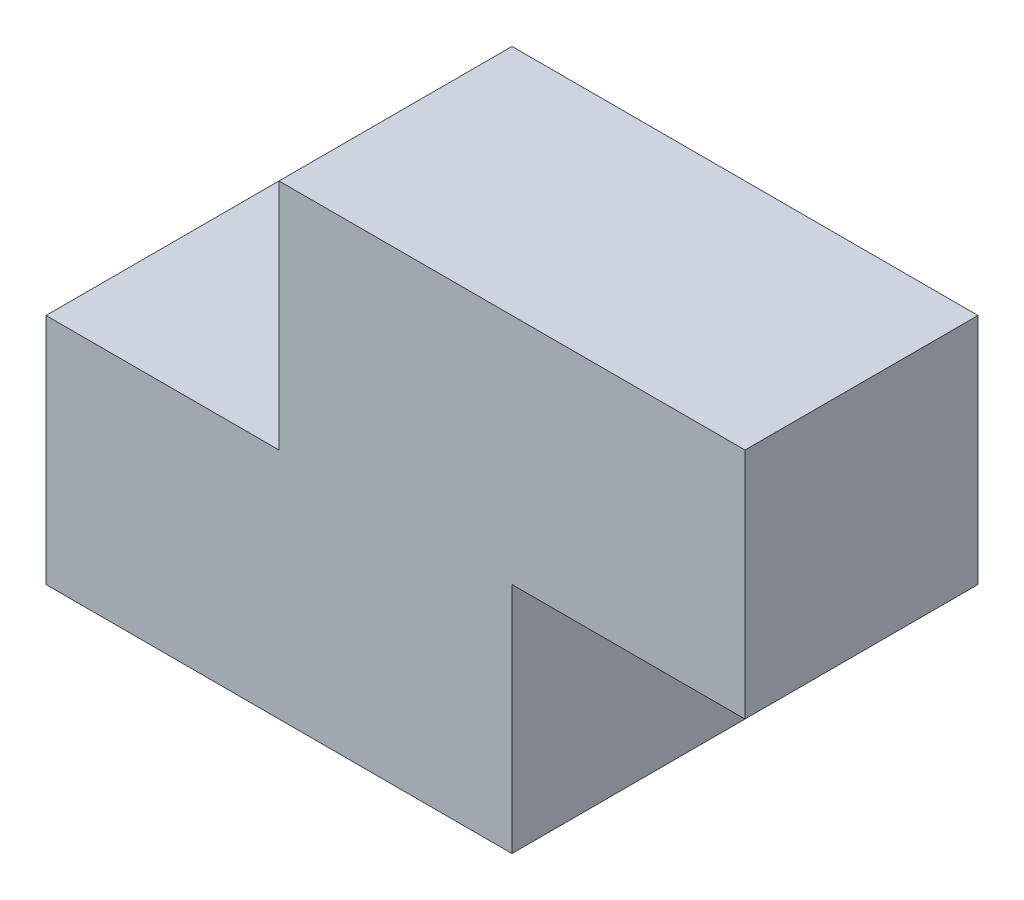
ISO-10303-21;
HEADER;
FILE_DESCRIPTION(('STEP AP214'),'2;1');
FILE_NAME('part.step','',(''),(''),'','','');
FILE_SCHEMA(('AUTOMOTIVE_DESIGN { 1 0 10303 214 1 1 1 1 }'));
ENDSEC;
DATA;
#1=APPLICATION_CONTEXT('core data for automotive mechanical design processes');
#2=APPLICATION_PROTOCOL_DEFINITION('international standard','automotive_design',2000,#1);
#3=PRODUCT_CONTEXT('',#1,'mechanical');
#4=PRODUCT('Part','Part','',(#3));
#5=PRODUCT_RELATED_PRODUCT_CATEGORY('part','',(#4));
#6=PRODUCT_DEFINITION_FORMATION('','',#4);
#7=PRODUCT_DEFINITION_CONTEXT('part definition',#1,'design');
#8=PRODUCT_DEFINITION('design','',#6,#7);
#9=PRODUCT_DEFINITION_SHAPE('','',#8);
#10=(LENGTH_UNIT() NAMED_UNIT(*) SI_UNIT(.MILLI.,.METRE.));
#11=(NAMED_UNIT(*) PLANE_ANGLE_UNIT() SI_UNIT($,.RADIAN.));
#12=(NAMED_UNIT(*) SI_UNIT($,.STERADIAN.) SOLID_ANGLE_UNIT());
#13=UNCERTAINTY_MEASURE_WITH_UNIT(LENGTH_MEASURE(1.E-05),#10,'distance_accuracy_value','');
#14=(GEOMETRIC_REPRESENTATION_CONTEXT(3) GLOBAL_UNCERTAINTY_ASSIGNED_CONTEXT((#13)) GLOBAL_UNIT_ASSIGNED_CONTEXT((#10,
#11,#12)) REPRESENTATION_CONTEXT('',''));
#15=CARTESIAN_POINT('',(0.,0.,0.));
#16=DIRECTION('',(0.,0.,1.));
#17=DIRECTION('',(1.,0.,0.));
#18=AXIS2_PLACEMENT_3D('',#15,#16,#17);
#19=CARTESIAN_POINT('',(-30.,30.,-30.));
#20=DIRECTION('',(-1.,0.,0.));
#21=DIRECTION('',(0.,-1.,0.));
#22=AXIS2_PLACEMENT_3D('',#19,#20,#21);
#23=PLANE('',#22);
#24=DIRECTION('',(0.,-1.,0.));
#25=VECTOR('',#24,1.);
#26=CARTESIAN_POINT('',(-30.,30.,0.));
#27=LINE('',#26,#25);
#28=CARTESIAN_POINT('',(-30.,30.,0.));
#29=VERTEX_POINT('',#28);
#30=CARTESIAN_POINT('',(-30.,0.,0.));
#31=VERTEX_POINT('',#30);
#32=EDGE_CURVE('E130',#29,#31,#27,.T.);
#33=ORIENTED_EDGE('',*,*,#32,.F.);
#34=DIRECTION('',(0.,0.,1.));
#35=VECTOR('',#34,1.);
#36=CARTESIAN_POINT('',(-30.,30.,-30.));
#37=LINE('',#36,#35);
#38=CARTESIAN_POINT('',(-30.,30.,-30.));
#39=VERTEX_POINT('',#38);
#40=EDGE_CURVE('E11',#39,#29,#37,.T.);
#41=ORIENTED_EDGE('',*,*,#40,.F.);
#42=DIRECTION('',(0.,-1.,0.));
#43=VECTOR('',#42,1.);
#44=CARTESIAN_POINT('',(-30.,30.,-30.));
#45=LINE('',#44,#43);
#46=CARTESIAN_POINT('',(-30.,0.,-30.));
#47=VERTEX_POINT('',#46);
#48=EDGE_CURVE('E150',#39,#47,#45,.T.);
#49=ORIENTED_EDGE('',*,*,#48,.T.);
#50=DIRECTION('',(0.,0.,1.));
#51=VECTOR('',#50,1.);
#52=CARTESIAN_POINT('',(-30.,0.,-30.));
#53=LINE('',#52,#51);
#54=EDGE_CURVE('E36',#47,#31,#53,.T.);
#55=ORIENTED_EDGE('',*,*,#54,.T.);
#56=EDGE_LOOP('',(#33,#41,#49,#55));
#57=FACE_BOUND('',#56,.T.);
#58=ADVANCED_FACE('F33',(#57),#23,.T.);
#59=CARTESIAN_POINT('',(0.,30.,-30.));
#60=DIRECTION('',(0.,1.,0.));
#61=DIRECTION('',(-1.,0.,0.));
#62=AXIS2_PLACEMENT_3D('',#59,#60,#61);
#63=PLANE('',#62);
#64=DIRECTION('',(-1.,0.,0.));
#65=VECTOR('',#64,1.);
#66=CARTESIAN_POINT('',(0.,30.,0.));
#67=LINE('',#66,#65);
#68=CARTESIAN_POINT('',(0.,30.,0.));
#69=VERTEX_POINT('',#68);
#70=EDGE_CURVE('E148',#69,#29,#67,.T.);
#71=ORIENTED_EDGE('',*,*,#70,.F.);
#72=DIRECTION('',(0.,0.,1.));
#73=VECTOR('',#72,1.);
#74=CARTESIAN_POINT('',(0.,30.,-30.));
#75=LINE('',#74,#73);
#76=CARTESIAN_POINT('',(0.,30.,-30.));
#77=VERTEX_POINT('',#76);
#78=EDGE_CURVE('E42',#77,#69,#75,.T.);
#79=ORIENTED_EDGE('',*,*,#78,.F.);
#80=DIRECTION('',(-1.,0.,0.));
#81=VECTOR('',#80,1.);
#82=CARTESIAN_POINT('',(0.,30.,-30.));
#83=LINE('',#82,#81);
#84=EDGE_CURVE('E120',#77,#39,#83,.T.);
#85=ORIENTED_EDGE('',*,*,#84,.T.);
#86=ORIENTED_EDGE('',*,*,#40,.T.);
#87=EDGE_LOOP('',(#71,#79,#85,#86));
#88=FACE_BOUND('',#87,.T.);
#89=ADVANCED_FACE('F162',(#88),#63,.T.);
#90=CARTESIAN_POINT('',(0.,60.,-30.));
#91=DIRECTION('',(-1.,0.,0.));
#92=DIRECTION('',(0.,-1.,0.));
#93=AXIS2_PLACEMENT_3D('',#90,#91,#92);
#94=PLANE('',#93);
#95=DIRECTION('',(0.,-1.,0.));
#96=VECTOR('',#95,1.);
#97=CARTESIAN_POINT('',(0.,60.,0.));
#98=LINE('',#97,#96);
#99=CARTESIAN_POINT('',(0.,60.,0.));
#100=VERTEX_POINT('',#99);
#101=EDGE_CURVE('E107',#100,#69,#98,.T.);
#102=ORIENTED_EDGE('',*,*,#101,.F.);
#103=DIRECTION('',(0.,0.,1.));
#104=VECTOR('',#103,1.);
#105=CARTESIAN_POINT('',(0.,60.,-30.));
#106=LINE('',#105,#104);
#107=CARTESIAN_POINT('',(0.,60.,-30.));
#108=VERTEX_POINT('',#107);
#109=EDGE_CURVE('E102',#108,#100,#106,.T.);
#110=ORIENTED_EDGE('',*,*,#109,.F.);
#111=DIRECTION('',(0.,-1.,0.));
#112=VECTOR('',#111,1.);
#113=CARTESIAN_POINT('',(0.,60.,-30.));
#114=LINE('',#113,#112);
#115=EDGE_CURVE('E105',#108,#77,#114,.T.);
#116=ORIENTED_EDGE('',*,*,#115,.T.);
#117=ORIENTED_EDGE('',*,*,#78,.T.);
#118=EDGE_LOOP('',(#102,#110,#116,#117));
#119=FACE_BOUND('',#118,.T.);
#120=ADVANCED_FACE('F104',(#119),#94,.T.);
#121=CARTESIAN_POINT('',(60.,60.,-30.));
#122=DIRECTION('',(0.,1.,0.));
#123=DIRECTION('',(-1.,0.,0.));
#124=AXIS2_PLACEMENT_3D('',#121,#122,#123);
#125=PLANE('',#124);
#126=DIRECTION('',(-1.,0.,0.));
#127=VECTOR('',#126,1.);
#128=CARTESIAN_POINT('',(60.,60.,0.));
#129=LINE('',#128,#127);
#130=CARTESIAN_POINT('',(60.,60.,0.));
#131=VERTEX_POINT('',#130);
#132=EDGE_CURVE('E145',#131,#100,#129,.T.);
#133=ORIENTED_EDGE('',*,*,#132,.F.);
#134=DIRECTION('',(0.,0.,1.));
#135=VECTOR('',#134,1.);
#136=CARTESIAN_POINT('',(60.,60.,-30.));
#137=LINE('',#136,#135);
#138=CARTESIAN_POINT('',(60.,60.,-30.));
#139=VERTEX_POINT('',#138);
#140=EDGE_CURVE('E112',#139,#131,#137,.T.);
#141=ORIENTED_EDGE('',*,*,#140,.F.);
#142=DIRECTION('',(-1.,0.,0.));
#143=VECTOR('',#142,1.);
#144=CARTESIAN_POINT('',(60.,60.,-30.));
#145=LINE('',#144,#143);
#146=EDGE_CURVE('E118',#139,#108,#145,.T.);
#147=ORIENTED_EDGE('',*,*,#146,.T.);
#148=ORIENTED_EDGE('',*,*,#109,.T.);
#149=EDGE_LOOP('',(#133,#141,#147,#148));
#150=FACE_BOUND('',#149,.T.);
#151=ADVANCED_FACE('F122',(#150),#125,.T.);
#152=CARTESIAN_POINT('',(60.,30.,-30.));
#153=DIRECTION('',(1.,0.,0.));
#154=DIRECTION('',(0.,0.,-1.));
#155=AXIS2_PLACEMENT_3D('',#152,#153,#154);
#156=PLANE('',#155);
#157=DIRECTION('',(0.,1.,0.));
#158=VECTOR('',#157,1.);
#159=CARTESIAN_POINT('',(60.,30.,0.));
#160=LINE('',#159,#158);
#161=CARTESIAN_POINT('',(60.,30.,0.));
#162=VERTEX_POINT('',#161);
#163=EDGE_CURVE('E142',#162,#131,#160,.T.);
#164=ORIENTED_EDGE('',*,*,#163,.F.);
#165=DIRECTION('',(0.,0.,1.));
#166=VECTOR('',#165,1.);
#167=CARTESIAN_POINT('',(60.,30.,-30.));
#168=LINE('',#167,#166);
#169=CARTESIAN_POINT('',(60.,30.,-30.));
#170=VERTEX_POINT('',#169);
#171=EDGE_CURVE('E154',#170,#162,#168,.T.);
#172=ORIENTED_EDGE('',*,*,#171,.F.);
#173=DIRECTION('',(0.,1.,0.));
#174=VECTOR('',#173,1.);
#175=CARTESIAN_POINT('',(60.,30.,-30.));
#176=LINE('',#175,#174);
#177=EDGE_CURVE('E123',#170,#139,#176,.T.);
#178=ORIENTED_EDGE('',*,*,#177,.T.);
#179=ORIENTED_EDGE('',*,*,#140,.T.);
#180=EDGE_LOOP('',(#164,#172,#178,#179));
#181=FACE_BOUND('',#180,.T.);
#182=ADVANCED_FACE('F175',(#181),#156,.T.);
#183=CARTESIAN_POINT('',(30.,30.,-30.));
#184=DIRECTION('',(0.,-1.,0.));
#185=DIRECTION('',(0.,0.,-1.));
#186=AXIS2_PLACEMENT_3D('',#183,#184,#185);
#187=PLANE('',#186);
#188=DIRECTION('',(1.,0.,0.));
#189=VECTOR('',#188,1.);
#190=CARTESIAN_POINT('',(30.,30.,0.));
#191=LINE('',#190,#189);
#192=CARTESIAN_POINT('',(30.,30.,0.));
#193=VERTEX_POINT('',#192);
#194=EDGE_CURVE('E139',#193,#162,#191,.T.);
#195=ORIENTED_EDGE('',*,*,#194,.F.);
#196=DIRECTION('',(0.,0.,1.));
#197=VECTOR('',#196,1.);
#198=CARTESIAN_POINT('',(30.,30.,-30.));
#199=LINE('',#198,#197);
#200=CARTESIAN_POINT('',(30.,30.,-30.));
#201=VERTEX_POINT('',#200);
#202=EDGE_CURVE('E156',#201,#193,#199,.T.);
#203=ORIENTED_EDGE('',*,*,#202,.F.);
#204=DIRECTION('',(1.,0.,0.));
#205=VECTOR('',#204,1.);
#206=CARTESIAN_POINT('',(30.,30.,-30.));
#207=LINE('',#206,#205);
#208=EDGE_CURVE('E125',#201,#170,#207,.T.);
#209=ORIENTED_EDGE('',*,*,#208,.T.);
#210=ORIENTED_EDGE('',*,*,#171,.T.);
#211=EDGE_LOOP('',(#195,#203,#209,#210));
#212=FACE_BOUND('',#211,.T.);
#213=ADVANCED_FACE('F178',(#212),#187,.T.);
#214=CARTESIAN_POINT('',(30.,0.,-30.));
#215=DIRECTION('',(1.,0.,0.));
#216=DIRECTION('',(0.,1.,0.));
#217=AXIS2_PLACEMENT_3D('',#214,#215,#216);
#218=PLANE('',#217);
#219=DIRECTION('',(0.,1.,0.));
#220=VECTOR('',#219,1.);
#221=CARTESIAN_POINT('',(30.,0.,0.));
#222=LINE('',#221,#220);
#223=CARTESIAN_POINT('',(30.,0.,0.));
#224=VERTEX_POINT('',#223);
#225=EDGE_CURVE('E136',#224,#193,#222,.T.);
#226=ORIENTED_EDGE('',*,*,#225,.F.);
#227=DIRECTION('',(0.,0.,1.));
#228=VECTOR('',#227,1.);
#229=CARTESIAN_POINT('',(30.,0.,-30.));
#230=LINE('',#229,#228);
#231=CARTESIAN_POINT('',(30.,0.,-30.));
#232=VERTEX_POINT('',#231);
#233=EDGE_CURVE('E157',#232,#224,#230,.T.);
#234=ORIENTED_EDGE('',*,*,#233,.F.);
#235=DIRECTION('',(0.,1.,0.));
#236=VECTOR('',#235,1.);
#237=CARTESIAN_POINT('',(30.,0.,-30.));
#238=LINE('',#237,#236);
#239=EDGE_CURVE('E253',#232,#201,#238,.T.);
#240=ORIENTED_EDGE('',*,*,#239,.T.);
#241=ORIENTED_EDGE('',*,*,#202,.T.);
#242=EDGE_LOOP('',(#226,#234,#240,#241));
#243=FACE_BOUND('',#242,.T.);
#244=ADVANCED_FACE('F182',(#243),#218,.T.);
#245=CARTESIAN_POINT('',(-30.,0.,-30.));
#246=DIRECTION('',(0.,-1.,0.));
#247=DIRECTION('',(1.,0.,0.));
#248=AXIS2_PLACEMENT_3D('',#245,#246,#247);
#249=PLANE('',#248);
#250=DIRECTION('',(1.,0.,0.));
#251=VECTOR('',#250,1.);
#252=CARTESIAN_POINT('',(-30.,0.,0.));
#253=LINE('',#252,#251);
#254=EDGE_CURVE('E133',#31,#224,#253,.T.);
#255=ORIENTED_EDGE('',*,*,#254,.F.);
#256=ORIENTED_EDGE('',*,*,#54,.F.);
#257=DIRECTION('',(1.,0.,0.));
#258=VECTOR('',#257,1.);
#259=CARTESIAN_POINT('',(-30.,0.,-30.));
#260=LINE('',#259,#258);
#261=EDGE_CURVE('E254',#47,#232,#260,.T.);
#262=ORIENTED_EDGE('',*,*,#261,.T.);
#263=ORIENTED_EDGE('',*,*,#233,.T.);
#264=EDGE_LOOP('',(#255,#256,#262,#263));
#265=FACE_BOUND('',#264,.T.);
#266=ADVANCED_FACE('F159',(#265),#249,.T.);
#267=CARTESIAN_POINT('',(0.,0.,-30.));
#268=DIRECTION('',(0.,0.,1.));
#269=DIRECTION('',(1.,0.,0.));
#270=AXIS2_PLACEMENT_3D('',#267,#268,#269);
#271=PLANE('',#270);
#272=ORIENTED_EDGE('',*,*,#48,.F.);
#273=ORIENTED_EDGE('',*,*,#84,.F.);
#274=ORIENTED_EDGE('',*,*,#115,.F.);
#275=ORIENTED_EDGE('',*,*,#146,.F.);
#276=ORIENTED_EDGE('',*,*,#177,.F.);
#277=ORIENTED_EDGE('',*,*,#208,.F.);
#278=ORIENTED_EDGE('',*,*,#239,.F.);
#279=ORIENTED_EDGE('',*,*,#261,.F.);
#280=EDGE_LOOP('',(#272,#273,#274,#275,#276,#277,#278,#279));
#281=FACE_BOUND('',#280,.T.);
#282=ADVANCED_FACE('F116',(#281),#271,.F.);
#283=CARTESIAN_POINT('',(0.,0.,0.));
#284=DIRECTION('',(0.,0.,1.));
#285=DIRECTION('',(1.,0.,0.));
#286=AXIS2_PLACEMENT_3D('',#283,#284,#285);
#287=PLANE('',#286);
#288=ORIENTED_EDGE('',*,*,#32,.T.);
#289=ORIENTED_EDGE('',*,*,#254,.T.);
#290=ORIENTED_EDGE('',*,*,#225,.T.);
#291=ORIENTED_EDGE('',*,*,#194,.T.);
#292=ORIENTED_EDGE('',*,*,#163,.T.);
#293=ORIENTED_EDGE('',*,*,#132,.T.);
#294=ORIENTED_EDGE('',*,*,#101,.T.);
#295=ORIENTED_EDGE('',*,*,#70,.T.);
#296=EDGE_LOOP('',(#288,#289,#290,#291,#292,#293,#294,#295));
#297=FACE_BOUND('',#296,.T.);
#298=ADVANCED_FACE('F161',(#297),#287,.T.);
#299=CLOSED_SHELL('',(#58,#89,#120,#151,#182,#213,#244,#266,#282,#298));
#300=MANIFOLD_SOLID_BREP('B2',#299);
#301=ADVANCED_BREP_SHAPE_REPRESENTATION('',(#18,#300),#14);
#302=SHAPE_DEFINITION_REPRESENTATION(#9,#301);
ENDSEC;
END-ISO-10303-21;
